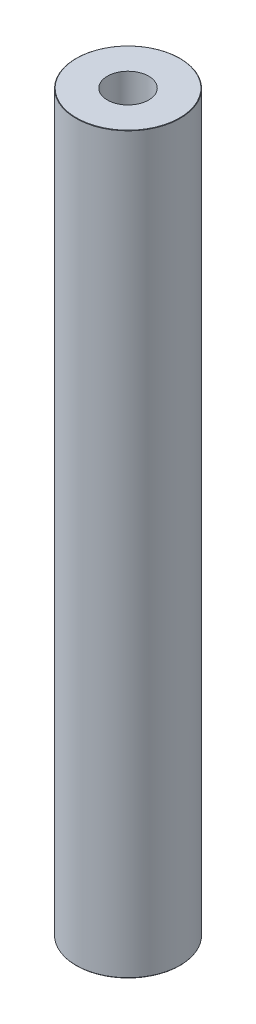
ISO-10303-21;
HEADER;
FILE_DESCRIPTION(('STEP AP214'),'2;1');
FILE_NAME('part.step','',(''),(''),'','','');
FILE_SCHEMA(('AUTOMOTIVE_DESIGN { 1 0 10303 214 1 1 1 1 }'));
ENDSEC;
DATA;
#1=APPLICATION_CONTEXT('core data for automotive mechanical design processes');
#2=APPLICATION_PROTOCOL_DEFINITION('international standard','automotive_design',2000,#1);
#3=PRODUCT_CONTEXT('',#1,'mechanical');
#4=PRODUCT('Part','Part','',(#3));
#5=PRODUCT_RELATED_PRODUCT_CATEGORY('part','',(#4));
#6=PRODUCT_DEFINITION_FORMATION('','',#4);
#7=PRODUCT_DEFINITION_CONTEXT('part definition',#1,'design');
#8=PRODUCT_DEFINITION('design','',#6,#7);
#9=PRODUCT_DEFINITION_SHAPE('','',#8);
#10=(LENGTH_UNIT() NAMED_UNIT(*) SI_UNIT(.MILLI.,.METRE.));
#11=(NAMED_UNIT(*) PLANE_ANGLE_UNIT() SI_UNIT($,.RADIAN.));
#12=(NAMED_UNIT(*) SI_UNIT($,.STERADIAN.) SOLID_ANGLE_UNIT());
#13=UNCERTAINTY_MEASURE_WITH_UNIT(LENGTH_MEASURE(1.E-05),#10,'distance_accuracy_value','');
#14=(GEOMETRIC_REPRESENTATION_CONTEXT(3) GLOBAL_UNCERTAINTY_ASSIGNED_CONTEXT((#13)) GLOBAL_UNIT_ASSIGNED_CONTEXT((#10,
#11,#12)) REPRESENTATION_CONTEXT('',''));
#15=CARTESIAN_POINT('',(0.,0.,0.));
#16=DIRECTION('',(0.,0.,1.));
#17=DIRECTION('',(1.,0.,0.));
#18=AXIS2_PLACEMENT_3D('',#15,#16,#17);
#19=CARTESIAN_POINT('',(0.,600.,0.));
#20=DIRECTION('',(0.,-1.,0.));
#21=DIRECTION('',(0.,0.,-1.));
#22=AXIS2_PLACEMENT_3D('',#19,#20,#21);
#23=CYLINDRICAL_SURFACE('',#22,42.5);
#24=CARTESIAN_POINT('',(0.,599.775752806109,0.));
#25=DIRECTION('',(0.,1.,0.));
#26=DIRECTION('',(0.,0.,1.));
#27=AXIS2_PLACEMENT_3D('',#24,#25,#26);
#28=CIRCLE('',#27,42.5);
#29=CARTESIAN_POINT('',(0.,599.775752806109,-42.5000000000001));
#30=VERTEX_POINT('',#29);
#31=EDGE_CURVE('E50',#30,#30,#28,.F.);
#32=ORIENTED_EDGE('',*,*,#31,.T.);
#33=EDGE_LOOP('',(#32));
#34=FACE_BOUND('',#33,.T.);
#35=CARTESIAN_POINT('',(0.,0.339037477825266,0.));
#36=DIRECTION('',(0.,1.,0.));
#37=DIRECTION('',(0.,0.,1.));
#38=AXIS2_PLACEMENT_3D('',#35,#36,#37);
#39=CIRCLE('',#38,42.5);
#40=CARTESIAN_POINT('',(0.,0.339037477825266,42.5));
#41=VERTEX_POINT('',#40);
#42=EDGE_CURVE('E51',#41,#41,#39,.T.);
#43=ORIENTED_EDGE('',*,*,#42,.T.);
#44=EDGE_LOOP('',(#43));
#45=FACE_BOUND('',#44,.T.);
#46=ADVANCED_FACE('F39',(#34,#45),#23,.T.);
#47=CARTESIAN_POINT('',(0.,600.,0.));
#48=DIRECTION('',(0.,1.,0.));
#49=DIRECTION('',(0.,0.,1.));
#50=AXIS2_PLACEMENT_3D('',#47,#48,#49);
#51=PLANE('',#50);
#52=CARTESIAN_POINT('',(0.,600.,0.));
#53=DIRECTION('',(0.,1.,0.));
#54=DIRECTION('',(0.,0.,1.));
#55=AXIS2_PLACEMENT_3D('',#52,#53,#54);
#56=CIRCLE('',#55,42.1609625221746);
#57=CARTESIAN_POINT('',(0.,600.,-42.1609625221747));
#58=VERTEX_POINT('',#57);
#59=EDGE_CURVE('E54',#58,#58,#56,.T.);
#60=ORIENTED_EDGE('',*,*,#59,.T.);
#61=EDGE_LOOP('',(#60));
#62=FACE_BOUND('',#61,.T.);
#63=CARTESIAN_POINT('',(0.,600.,0.));
#64=DIRECTION('',(0.,1.,0.));
#65=DIRECTION('',(0.,0.,1.));
#66=AXIS2_PLACEMENT_3D('',#63,#64,#65);
#67=CIRCLE('',#66,16.9058926989124);
#68=CARTESIAN_POINT('',(0.,600.,16.9058926989124));
#69=VERTEX_POINT('',#68);
#70=EDGE_CURVE('E58',#69,#69,#67,.T.);
#71=ORIENTED_EDGE('',*,*,#70,.F.);
#72=EDGE_LOOP('',(#71));
#73=FACE_BOUND('',#72,.T.);
#74=ADVANCED_FACE('F69',(#62,#73),#51,.T.);
#75=CARTESIAN_POINT('',(0.,0.,0.));
#76=DIRECTION('',(0.,1.,0.));
#77=DIRECTION('',(0.,0.,1.));
#78=AXIS2_PLACEMENT_3D('',#75,#76,#77);
#79=PLANE('',#78);
#80=CARTESIAN_POINT('',(0.,0.,0.));
#81=DIRECTION('',(0.,1.,0.));
#82=DIRECTION('',(0.,0.,1.));
#83=AXIS2_PLACEMENT_3D('',#80,#81,#82);
#84=CIRCLE('',#83,42.275752806109);
#85=CARTESIAN_POINT('',(0.,0.,42.275752806109));
#86=VERTEX_POINT('',#85);
#87=EDGE_CURVE('E10',#86,#86,#84,.F.);
#88=ORIENTED_EDGE('',*,*,#87,.T.);
#89=EDGE_LOOP('',(#88));
#90=FACE_BOUND('',#89,.T.);
#91=CARTESIAN_POINT('',(0.,0.,0.));
#92=DIRECTION('',(0.,1.,0.));
#93=DIRECTION('',(0.,0.,1.));
#94=AXIS2_PLACEMENT_3D('',#91,#92,#93);
#95=CIRCLE('',#94,16.9058926989124);
#96=CARTESIAN_POINT('',(0.,0.,16.9058926989124));
#97=VERTEX_POINT('',#96);
#98=EDGE_CURVE('E63',#97,#97,#95,.T.);
#99=ORIENTED_EDGE('',*,*,#98,.T.);
#100=EDGE_LOOP('',(#99));
#101=FACE_BOUND('',#100,.T.);
#102=ADVANCED_FACE('F75',(#90,#101),#79,.F.);
#103=CARTESIAN_POINT('',(0.,600.,0.));
#104=DIRECTION('',(0.,-1.,0.));
#105=DIRECTION('',(0.,0.,-1.));
#106=AXIS2_PLACEMENT_3D('',#103,#104,#105);
#107=CYLINDRICAL_SURFACE('',#106,16.9058926989124);
#108=ORIENTED_EDGE('',*,*,#70,.T.);
#109=EDGE_LOOP('',(#108));
#110=FACE_BOUND('',#109,.T.);
#111=ORIENTED_EDGE('',*,*,#98,.F.);
#112=EDGE_LOOP('',(#111));
#113=FACE_BOUND('',#112,.T.);
#114=ADVANCED_FACE('F70',(#110,#113),#107,.F.);
#115=CARTESIAN_POINT('',(0.,600.,0.));
#116=DIRECTION('',(0.,-1.,0.));
#117=DIRECTION('',(0.,0.,-1.));
#118=AXIS2_PLACEMENT_3D('',#115,#116,#117);
#119=CONICAL_SURFACE('',#118,42.1609625221746,0.986432728168845);
#120=CARTESIAN_POINT('',(0.,599.775752806109,-42.5000000000001));
#121=CARTESIAN_POINT('',(0.,599.778088714379,-42.4964683596061));
#122=CARTESIAN_POINT('',(0.,599.780424622648,-42.4929367192121));
#123=CARTESIAN_POINT('',(0.,599.785096439188,-42.485873438424));
#124=CARTESIAN_POINT('',(0.,599.787432347457,-42.48234179803));
#125=CARTESIAN_POINT('',(0.,599.792104163997,-42.475278517242));
#126=CARTESIAN_POINT('',(0.,599.794440072266,-42.471746876848));
#127=CARTESIAN_POINT('',(0.,599.799111888806,-42.4646835960599));
#128=CARTESIAN_POINT('',(0.,599.801447797076,-42.4611519556659));
#129=CARTESIAN_POINT('',(0.,599.806119613615,-42.4540886748779));
#130=CARTESIAN_POINT('',(0.,599.808455521885,-42.4505570344839));
#131=CARTESIAN_POINT('',(0.,599.813127338424,-42.4434937536959));
#132=CARTESIAN_POINT('',(0.,599.815463246694,-42.4399621133018));
#133=CARTESIAN_POINT('',(0.,599.820135063233,-42.4328988325138));
#134=CARTESIAN_POINT('',(0.,599.822470971503,-42.4293671921198));
#135=CARTESIAN_POINT('',(0.,599.827142788042,-42.4223039113318));
#136=CARTESIAN_POINT('',(0.,599.829478696312,-42.4187722709378));
#137=CARTESIAN_POINT('',(0.,599.834150512851,-42.4117089901497));
#138=CARTESIAN_POINT('',(0.,599.836486421121,-42.4081773497557));
#139=CARTESIAN_POINT('',(0.,599.84115823766,-42.4011140689677));
#140=CARTESIAN_POINT('',(0.,599.84349414593,-42.3975824285737));
#141=CARTESIAN_POINT('',(0.,599.84816596247,-42.3905191477856));
#142=CARTESIAN_POINT('',(0.,599.850501870739,-42.3869875073916));
#143=CARTESIAN_POINT('',(0.,599.855173687279,-42.3799242266036));
#144=CARTESIAN_POINT('',(0.,599.857509595548,-42.3763925862096));
#145=CARTESIAN_POINT('',(0.,599.862181412088,-42.3693293054216));
#146=CARTESIAN_POINT('',(0.,599.864517320357,-42.3657976650275));
#147=CARTESIAN_POINT('',(0.,599.869189136897,-42.3587343842395));
#148=CARTESIAN_POINT('',(0.,599.871525045167,-42.3552027438455));
#149=CARTESIAN_POINT('',(0.,599.876196861706,-42.3481394630575));
#150=CARTESIAN_POINT('',(0.,599.878532769976,-42.3446078226634));
#151=CARTESIAN_POINT('',(0.,599.883204586515,-42.3375445418754));
#152=CARTESIAN_POINT('',(0.,599.885540494785,-42.3340129014814));
#153=CARTESIAN_POINT('',(0.,599.890212311324,-42.3269496206934));
#154=CARTESIAN_POINT('',(0.,599.892548219594,-42.3234179802994));
#155=CARTESIAN_POINT('',(0.,599.897220036133,-42.3163546995113));
#156=CARTESIAN_POINT('',(0.,599.899555944403,-42.3128230591173));
#157=CARTESIAN_POINT('',(0.,599.904227760942,-42.3057597783293));
#158=CARTESIAN_POINT('',(0.,599.906563669212,-42.3022281379353));
#159=CARTESIAN_POINT('',(0.,599.911235485751,-42.2951648571472));
#160=CARTESIAN_POINT('',(0.,599.913571394021,-42.2916332167532));
#161=CARTESIAN_POINT('',(0.,599.91824321056,-42.2845699359652));
#162=CARTESIAN_POINT('',(0.,599.92057911883,-42.2810382955712));
#163=CARTESIAN_POINT('',(0.,599.92525093537,-42.2739750147832));
#164=CARTESIAN_POINT('',(0.,599.927586843639,-42.2704433743891));
#165=CARTESIAN_POINT('',(0.,599.932258660179,-42.2633800936011));
#166=CARTESIAN_POINT('',(0.,599.934594568448,-42.2598484532071));
#167=CARTESIAN_POINT('',(0.,599.939266384988,-42.2527851724191));
#168=CARTESIAN_POINT('',(0.,599.941602293257,-42.2492535320251));
#169=CARTESIAN_POINT('',(0.,599.946274109797,-42.242190251237));
#170=CARTESIAN_POINT('',(0.,599.948610018067,-42.238658610843));
#171=CARTESIAN_POINT('',(0.,599.953281834606,-42.231595330055));
#172=CARTESIAN_POINT('',(0.,599.955617742876,-42.228063689661));
#173=CARTESIAN_POINT('',(0.,599.960289559415,-42.2210004088729));
#174=CARTESIAN_POINT('',(0.,599.962625467685,-42.2174687684789));
#175=CARTESIAN_POINT('',(0.,599.967297284224,-42.2104054876909));
#176=CARTESIAN_POINT('',(0.,599.969633192494,-42.2068738472969));
#177=CARTESIAN_POINT('',(0.,599.974305009033,-42.1998105665089));
#178=CARTESIAN_POINT('',(0.,599.976640917303,-42.1962789261148));
#179=CARTESIAN_POINT('',(0.,599.981312733842,-42.1892156453268));
#180=CARTESIAN_POINT('',(0.,599.983648642112,-42.1856840049328));
#181=CARTESIAN_POINT('',(0.,599.988320458652,-42.1786207241448));
#182=CARTESIAN_POINT('',(0.,599.990656366921,-42.1750890837507));
#183=CARTESIAN_POINT('',(0.,599.995328183461,-42.1680258029627));
#184=CARTESIAN_POINT('',(0.,599.99766409173,-42.1644941625687));
#185=CARTESIAN_POINT('',(0.,600.,-42.1609625221747));
#186=B_SPLINE_CURVE_WITH_KNOTS('',3,(#120,#121,#122,#123,#124,#125,#126,#127,#128,#129,#130,
#131,#132,#133,#134,#135,#136,#137,#138,#139,#140,#141,#142,#143,#144,#145,#146,#147,#148,#149,
#150,#151,#152,#153,#154,#155,#156,#157,#158,#159,#160,#161,#162,#163,#164,#165,#166,#167,#168,
#169,#170,#171,#172,#173,#174,#175,#176,#177,#178,#179,#180,#181,#182,#183,#184,#185),
.UNSPECIFIED.,.F.,.F.,(4,2,2,2,2,2,2,2,2,2,2,2,2,2,2,2,2,2,2,2,2,2,2,2,2,2,2,2,2,2,2,2,4),(0.,
0.0127027777219728,0.0254055554439456,0.0381083331659185,0.0508111108878913,0.0635138886098699,
0.0762166663318427,0.0889194440538155,0.101622221775788,0.114324999497761,0.127027777219734,
0.139730554941646,0.152433332663618,0.165136110385597,0.17783888810757,0.190541665829543,
0.203244443551515,0.215947221273488,0.228649998995461,0.241352776717434,0.254055554439407,
0.266758332161385,0.279461109883297,0.29216388760527,0.304866665327243,0.317569443049215,
0.330272220771188,0.342974998493161,0.355677776215134,0.368380553937113,0.381083331659085,
0.393786109381058,0.406488887103031),.UNSPECIFIED.);
#187=EDGE_CURVE('BSEAM81',#30,#58,#186,.T.);
#188=ORIENTED_EDGE('',*,*,#31,.F.);
#189=ORIENTED_EDGE('',*,*,#59,.F.);
#190=ORIENTED_EDGE('',*,*,#187,.T.);
#191=ORIENTED_EDGE('',*,*,#187,.F.);
#192=EDGE_LOOP('',(#188,#190,#189,#191));
#193=FACE_BOUND('',#192,.T.);
#194=ADVANCED_FACE('F81',(#193),#119,.T.);
#195=CARTESIAN_POINT('',(0.,0.339037477825266,0.));
#196=DIRECTION('',(0.,1.,0.));
#197=DIRECTION('',(0.,0.,1.));
#198=AXIS2_PLACEMENT_3D('',#195,#196,#197);
#199=CONICAL_SURFACE('',#198,42.5,0.584363598626183);
#200=ORIENTED_EDGE('',*,*,#87,.F.);
#201=EDGE_LOOP('',(#200));
#202=FACE_BOUND('',#201,.T.);
#203=ORIENTED_EDGE('',*,*,#42,.F.);
#204=EDGE_LOOP('',(#203));
#205=FACE_BOUND('',#204,.T.);
#206=ADVANCED_FACE('F45',(#202,#205),#199,.T.);
#207=CLOSED_SHELL('',(#46,#74,#102,#114,#194,#206));
#208=MANIFOLD_SOLID_BREP('B2',#207);
#209=ADVANCED_BREP_SHAPE_REPRESENTATION('',(#18,#208),#14);
#210=SHAPE_DEFINITION_REPRESENTATION(#9,#209);
ENDSEC;
END-ISO-10303-21;
